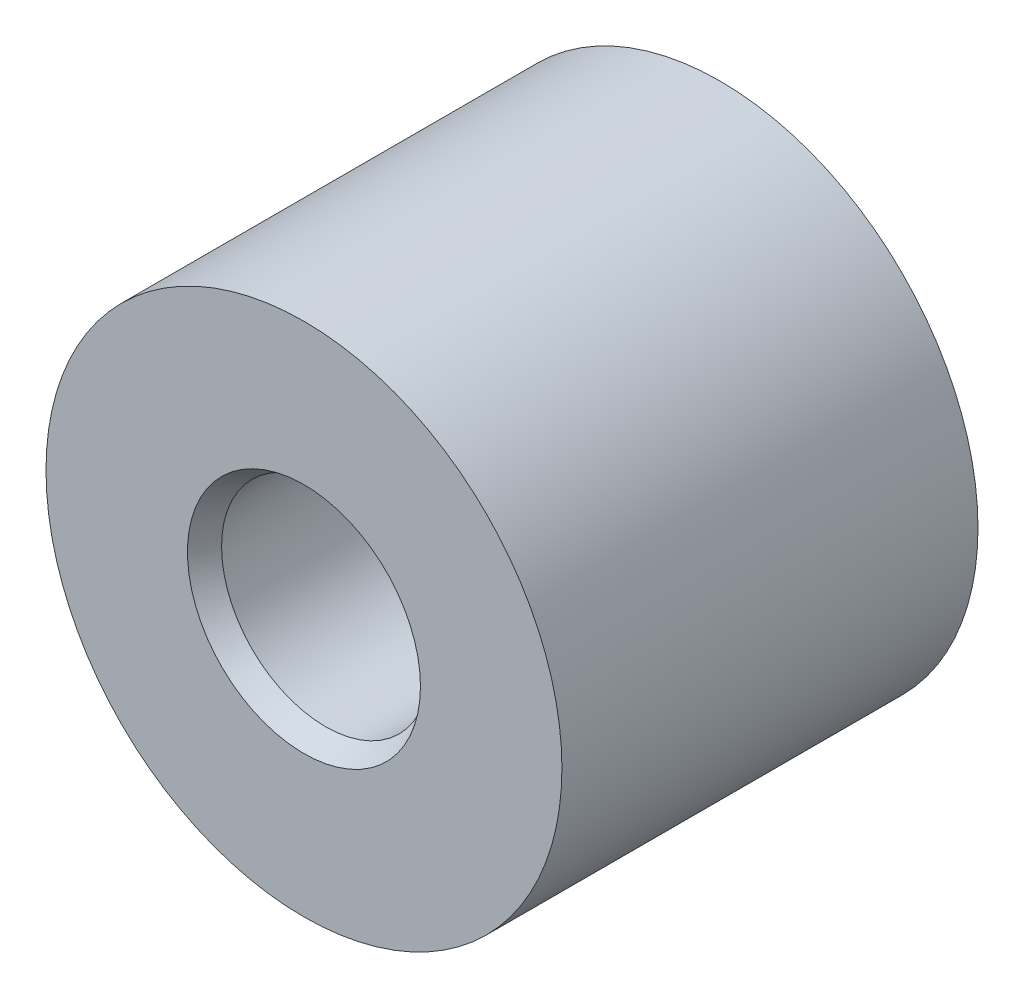
ISO-10303-21;
HEADER;
FILE_DESCRIPTION(('STEP AP214'),'2;1');
FILE_NAME('part.step','',(''),(''),'','','');
FILE_SCHEMA(('AUTOMOTIVE_DESIGN { 1 0 10303 214 1 1 1 1 }'));
ENDSEC;
DATA;
#1=APPLICATION_CONTEXT('core data for automotive mechanical design processes');
#2=APPLICATION_PROTOCOL_DEFINITION('international standard','automotive_design',2000,#1);
#3=PRODUCT_CONTEXT('',#1,'mechanical');
#4=PRODUCT('Part','Part','',(#3));
#5=PRODUCT_RELATED_PRODUCT_CATEGORY('part','',(#4));
#6=PRODUCT_DEFINITION_FORMATION('','',#4);
#7=PRODUCT_DEFINITION_CONTEXT('part definition',#1,'design');
#8=PRODUCT_DEFINITION('design','',#6,#7);
#9=PRODUCT_DEFINITION_SHAPE('','',#8);
#10=(LENGTH_UNIT() NAMED_UNIT(*) SI_UNIT(.MILLI.,.METRE.));
#11=(NAMED_UNIT(*) PLANE_ANGLE_UNIT() SI_UNIT($,.RADIAN.));
#12=(NAMED_UNIT(*) SI_UNIT($,.STERADIAN.) SOLID_ANGLE_UNIT());
#13=UNCERTAINTY_MEASURE_WITH_UNIT(LENGTH_MEASURE(1.E-05),#10,'distance_accuracy_value','');
#14=(GEOMETRIC_REPRESENTATION_CONTEXT(3) GLOBAL_UNCERTAINTY_ASSIGNED_CONTEXT((#13)) GLOBAL_UNIT_ASSIGNED_CONTEXT((#10,
#11,#12)) REPRESENTATION_CONTEXT('',''));
#15=CARTESIAN_POINT('',(0.,0.,0.));
#16=DIRECTION('',(0.,0.,1.));
#17=DIRECTION('',(1.,0.,0.));
#18=AXIS2_PLACEMENT_3D('',#15,#16,#17);
#19=CARTESIAN_POINT('',(0.,0.,-5.));
#20=DIRECTION('',(0.,0.,1.));
#21=DIRECTION('',(1.,0.,0.));
#22=AXIS2_PLACEMENT_3D('',#19,#20,#21);
#23=CYLINDRICAL_SURFACE('',#22,3.1);
#24=CARTESIAN_POINT('',(0.,0.,-5.));
#25=DIRECTION('',(0.,0.,1.));
#26=DIRECTION('',(1.,0.,0.));
#27=AXIS2_PLACEMENT_3D('',#24,#25,#26);
#28=CIRCLE('',#27,3.1);
#29=CARTESIAN_POINT('',(3.1,0.,-5.));
#30=VERTEX_POINT('',#29);
#31=EDGE_CURVE('E12',#30,#30,#28,.T.);
#32=ORIENTED_EDGE('',*,*,#31,.T.);
#33=EDGE_LOOP('',(#32));
#34=FACE_BOUND('',#33,.T.);
#35=CARTESIAN_POINT('',(0.,0.,0.));
#36=DIRECTION('',(0.,0.,1.));
#37=DIRECTION('',(1.,0.,0.));
#38=AXIS2_PLACEMENT_3D('',#35,#36,#37);
#39=CIRCLE('',#38,3.1);
#40=CARTESIAN_POINT('',(3.1,0.,0.));
#41=VERTEX_POINT('',#40);
#42=EDGE_CURVE('E49',#41,#41,#39,.T.);
#43=ORIENTED_EDGE('',*,*,#42,.F.);
#44=EDGE_LOOP('',(#43));
#45=FACE_BOUND('',#44,.T.);
#46=ADVANCED_FACE('F46',(#34,#45),#23,.T.);
#47=CARTESIAN_POINT('',(0.,0.,-5.));
#48=DIRECTION('',(0.,0.,1.));
#49=DIRECTION('',(1.,0.,0.));
#50=AXIS2_PLACEMENT_3D('',#47,#48,#49);
#51=PLANE('',#50);
#52=CARTESIAN_POINT('',(0.,0.,-5.));
#53=DIRECTION('',(0.,0.,1.));
#54=DIRECTION('',(1.,0.,0.));
#55=AXIS2_PLACEMENT_3D('',#52,#53,#54);
#56=CIRCLE('',#55,1.25);
#57=CARTESIAN_POINT('',(1.25,0.,-5.));
#58=VERTEX_POINT('',#57);
#59=EDGE_CURVE('E56',#58,#58,#56,.T.);
#60=ORIENTED_EDGE('',*,*,#59,.T.);
#61=EDGE_LOOP('',(#60));
#62=FACE_BOUND('',#61,.T.);
#63=ORIENTED_EDGE('',*,*,#31,.F.);
#64=EDGE_LOOP('',(#63));
#65=FACE_BOUND('',#64,.T.);
#66=ADVANCED_FACE('F73',(#62,#65),#51,.F.);
#67=CARTESIAN_POINT('',(0.,0.,0.));
#68=DIRECTION('',(0.,0.,1.));
#69=DIRECTION('',(1.,0.,0.));
#70=AXIS2_PLACEMENT_3D('',#67,#68,#69);
#71=PLANE('',#70);
#72=CARTESIAN_POINT('',(0.,0.,0.));
#73=DIRECTION('',(0.,0.,1.));
#74=DIRECTION('',(1.,0.,0.));
#75=AXIS2_PLACEMENT_3D('',#72,#73,#74);
#76=CIRCLE('',#75,1.4);
#77=CARTESIAN_POINT('',(1.4,0.,0.));
#78=VERTEX_POINT('',#77);
#79=EDGE_CURVE('E63',#78,#78,#76,.T.);
#80=ORIENTED_EDGE('',*,*,#79,.F.);
#81=EDGE_LOOP('',(#80));
#82=FACE_BOUND('',#81,.T.);
#83=ORIENTED_EDGE('',*,*,#42,.T.);
#84=EDGE_LOOP('',(#83));
#85=FACE_BOUND('',#84,.T.);
#86=ADVANCED_FACE('F69',(#82,#85),#71,.T.);
#87=CARTESIAN_POINT('',(0.,0.,0.));
#88=DIRECTION('',(0.,0.,1.));
#89=DIRECTION('',(1.,0.,0.));
#90=AXIS2_PLACEMENT_3D('',#87,#88,#89);
#91=CYLINDRICAL_SURFACE('',#90,1.25);
#92=ORIENTED_EDGE('',*,*,#59,.F.);
#93=EDGE_LOOP('',(#92));
#94=FACE_BOUND('',#93,.T.);
#95=CARTESIAN_POINT('',(0.,0.,-0.259807621135331));
#96=DIRECTION('',(0.,0.,1.));
#97=DIRECTION('',(1.,0.,0.));
#98=AXIS2_PLACEMENT_3D('',#95,#96,#97);
#99=CIRCLE('',#98,1.25);
#100=CARTESIAN_POINT('',(1.25,0.,-0.259807621135331));
#101=VERTEX_POINT('',#100);
#102=EDGE_CURVE('E60',#101,#101,#99,.T.);
#103=ORIENTED_EDGE('',*,*,#102,.T.);
#104=EDGE_LOOP('',(#103));
#105=FACE_BOUND('',#104,.T.);
#106=ADVANCED_FACE('F72',(#94,#105),#91,.F.);
#107=CARTESIAN_POINT('',(0.,0.,0.));
#108=DIRECTION('',(0.,0.,1.));
#109=DIRECTION('',(1.,0.,0.));
#110=AXIS2_PLACEMENT_3D('',#107,#108,#109);
#111=CONICAL_SURFACE('',#110,1.4,0.5235987755983);
#112=ORIENTED_EDGE('',*,*,#102,.F.);
#113=EDGE_LOOP('',(#112));
#114=FACE_BOUND('',#113,.T.);
#115=ORIENTED_EDGE('',*,*,#79,.T.);
#116=EDGE_LOOP('',(#115));
#117=FACE_BOUND('',#116,.T.);
#118=ADVANCED_FACE('F67',(#114,#117),#111,.F.);
#119=CLOSED_SHELL('',(#46,#66,#86,#106,#118));
#120=MANIFOLD_SOLID_BREP('B2',#119);
#121=ADVANCED_BREP_SHAPE_REPRESENTATION('',(#18,#120),#14);
#122=SHAPE_DEFINITION_REPRESENTATION(#9,#121);
ENDSEC;
END-ISO-10303-21;
